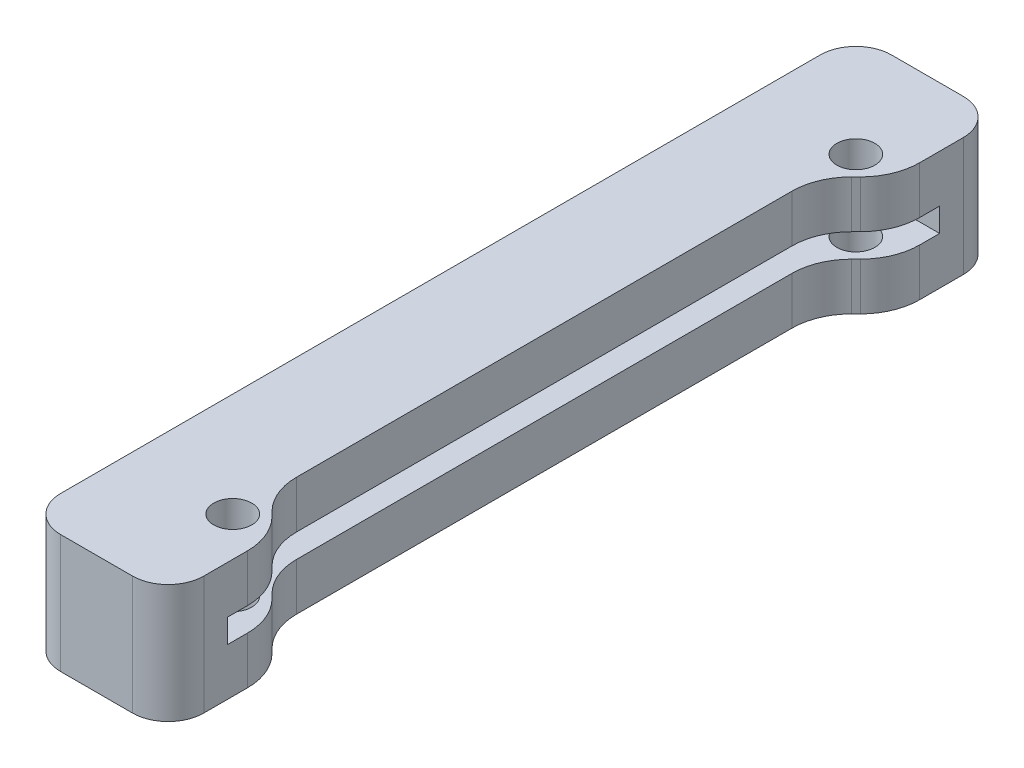
ISO-10303-21;
HEADER;
FILE_DESCRIPTION(('STEP AP214'),'2;1');
FILE_NAME('part.step','',(''),(''),'','','');
FILE_SCHEMA(('AUTOMOTIVE_DESIGN { 1 0 10303 214 1 1 1 1 }'));
ENDSEC;
DATA;
#1=APPLICATION_CONTEXT('core data for automotive mechanical design processes');
#2=APPLICATION_PROTOCOL_DEFINITION('international standard','automotive_design',2000,#1);
#3=PRODUCT_CONTEXT('',#1,'mechanical');
#4=PRODUCT('Part','Part','',(#3));
#5=PRODUCT_RELATED_PRODUCT_CATEGORY('part','',(#4));
#6=PRODUCT_DEFINITION_FORMATION('','',#4);
#7=PRODUCT_DEFINITION_CONTEXT('part definition',#1,'design');
#8=PRODUCT_DEFINITION('design','',#6,#7);
#9=PRODUCT_DEFINITION_SHAPE('','',#8);
#10=(LENGTH_UNIT() NAMED_UNIT(*) SI_UNIT(.MILLI.,.METRE.));
#11=(NAMED_UNIT(*) PLANE_ANGLE_UNIT() SI_UNIT($,.RADIAN.));
#12=(NAMED_UNIT(*) SI_UNIT($,.STERADIAN.) SOLID_ANGLE_UNIT());
#13=UNCERTAINTY_MEASURE_WITH_UNIT(LENGTH_MEASURE(1.E-05),#10,'distance_accuracy_value','');
#14=(GEOMETRIC_REPRESENTATION_CONTEXT(3) GLOBAL_UNCERTAINTY_ASSIGNED_CONTEXT((#13)) GLOBAL_UNIT_ASSIGNED_CONTEXT((#10,
#11,#12)) REPRESENTATION_CONTEXT('',''));
#15=CARTESIAN_POINT('',(0.,0.,0.));
#16=DIRECTION('',(0.,0.,1.));
#17=DIRECTION('',(1.,0.,0.));
#18=AXIS2_PLACEMENT_3D('',#15,#16,#17);
#19=CARTESIAN_POINT('',(-81.6925612369298,5.,26.25));
#20=DIRECTION('',(-1.,0.,0.));
#21=DIRECTION('',(0.,0.,1.));
#22=AXIS2_PLACEMENT_3D('',#19,#20,#21);
#23=PLANE('',#22);
#24=DIRECTION('',(0.,0.,-1.));
#25=VECTOR('',#24,1.);
#26=CARTESIAN_POINT('',(-81.6925612369298,5.,35.));
#27=LINE('',#26,#25);
#28=CARTESIAN_POINT('',(-81.6925612369298,5.,32.));
#29=VERTEX_POINT('',#28);
#30=CARTESIAN_POINT('',(-81.6925612369298,5.,28.3210678118655));
#31=VERTEX_POINT('',#30);
#32=EDGE_CURVE('E349',#29,#31,#27,.T.);
#33=ORIENTED_EDGE('',*,*,#32,.F.);
#34=DIRECTION('',(0.,-1.,0.));
#35=VECTOR('',#34,1.);
#36=CARTESIAN_POINT('',(-81.6925612369298,5.,32.));
#37=LINE('',#36,#35);
#38=CARTESIAN_POINT('',(-81.6925612369298,-5.,32.));
#39=VERTEX_POINT('',#38);
#40=EDGE_CURVE('E11',#29,#39,#37,.T.);
#41=ORIENTED_EDGE('',*,*,#40,.T.);
#42=DIRECTION('',(0.,0.,-1.));
#43=VECTOR('',#42,1.);
#44=CARTESIAN_POINT('',(-81.6925612369298,-5.,26.25));
#45=LINE('',#44,#43);
#46=CARTESIAN_POINT('',(-81.6925612369298,-5.,28.3210678118655));
#47=VERTEX_POINT('',#46);
#48=EDGE_CURVE('E375',#39,#47,#45,.T.);
#49=ORIENTED_EDGE('',*,*,#48,.T.);
#50=DIRECTION('',(0.,-1.,0.));
#51=VECTOR('',#50,1.);
#52=CARTESIAN_POINT('',(-81.6925612369298,5.,28.3210678118655));
#53=LINE('',#52,#51);
#54=CARTESIAN_POINT('',(-81.6925612369298,-1.,28.3210678118655));
#55=VERTEX_POINT('',#54);
#56=EDGE_CURVE('E422',#47,#55,#53,.F.);
#57=ORIENTED_EDGE('',*,*,#56,.T.);
#58=DIRECTION('',(0.,0.,-1.));
#59=VECTOR('',#58,1.);
#60=CARTESIAN_POINT('',(-81.6925612369298,-1.,26.25));
#61=LINE('',#60,#59);
#62=CARTESIAN_POINT('',(-81.6925612369298,-1.,30.));
#63=VERTEX_POINT('',#62);
#64=EDGE_CURVE('E314',#63,#55,#61,.T.);
#65=ORIENTED_EDGE('',*,*,#64,.F.);
#66=DIRECTION('',(0.,1.,0.));
#67=VECTOR('',#66,1.);
#68=CARTESIAN_POINT('',(-81.6925612369298,5.,30.));
#69=LINE('',#68,#67);
#70=CARTESIAN_POINT('',(-81.6925612369298,1.,30.));
#71=VERTEX_POINT('',#70);
#72=EDGE_CURVE('E246',#63,#71,#69,.T.);
#73=ORIENTED_EDGE('',*,*,#72,.T.);
#74=DIRECTION('',(0.,0.,-1.));
#75=VECTOR('',#74,1.);
#76=CARTESIAN_POINT('',(-81.6925612369298,1.,26.25));
#77=LINE('',#76,#75);
#78=CARTESIAN_POINT('',(-81.6925612369298,1.,28.3210678118655));
#79=VERTEX_POINT('',#78);
#80=EDGE_CURVE('E290',#71,#79,#77,.T.);
#81=ORIENTED_EDGE('',*,*,#80,.T.);
#82=DIRECTION('',(0.,-1.,0.));
#83=VECTOR('',#82,1.);
#84=CARTESIAN_POINT('',(-81.6925612369298,5.,28.3210678118655));
#85=LINE('',#84,#83);
#86=EDGE_CURVE('E418',#79,#31,#85,.F.);
#87=ORIENTED_EDGE('',*,*,#86,.T.);
#88=EDGE_LOOP('',(#33,#41,#49,#57,#65,#73,#81,#87));
#89=FACE_BOUND('',#88,.T.);
#90=ADVANCED_FACE('F39',(#89),#23,.F.);
#91=CARTESIAN_POINT('',(-81.6925612369298,5.,26.25));
#92=DIRECTION('',(-0.707106781186545,0.,0.70710678118655));
#93=DIRECTION('',(0.70710678118655,0.,0.707106781186545));
#94=AXIS2_PLACEMENT_3D('',#91,#92,#93);
#95=PLANE('',#94);
#96=DIRECTION('',(-0.70710678118655,0.,-0.707106781186545));
#97=VECTOR('',#96,1.);
#98=CARTESIAN_POINT('',(-81.6925612369298,-1.,26.25));
#99=LINE('',#98,#97);
#100=CARTESIAN_POINT('',(-83.1570273309971,-1.,24.7855339059327));
#101=VERTEX_POINT('',#100);
#102=CARTESIAN_POINT('',(-83.5355339059327,-1.,24.4070273309971));
#103=VERTEX_POINT('',#102);
#104=EDGE_CURVE('E310',#101,#103,#99,.T.);
#105=ORIENTED_EDGE('',*,*,#104,.F.);
#106=DIRECTION('',(0.,-1.,0.));
#107=VECTOR('',#106,1.);
#108=CARTESIAN_POINT('',(-83.1570273309971,5.,24.7855339059327));
#109=LINE('',#108,#107);
#110=CARTESIAN_POINT('',(-83.1570273309971,-5.,24.7855339059327));
#111=VERTEX_POINT('',#110);
#112=EDGE_CURVE('E407',#101,#111,#109,.T.);
#113=ORIENTED_EDGE('',*,*,#112,.T.);
#114=DIRECTION('',(-0.70710678118655,0.,-0.707106781186545));
#115=VECTOR('',#114,1.);
#116=CARTESIAN_POINT('',(-81.6925612369298,-5.,26.25));
#117=LINE('',#116,#115);
#118=CARTESIAN_POINT('',(-83.5355339059327,-5.,24.4070273309971));
#119=VERTEX_POINT('',#118);
#120=EDGE_CURVE('E378',#111,#119,#117,.T.);
#121=ORIENTED_EDGE('',*,*,#120,.T.);
#122=DIRECTION('',(0.,-1.,0.));
#123=VECTOR('',#122,1.);
#124=CARTESIAN_POINT('',(-83.5355339059327,-1.,24.4070273309971));
#125=LINE('',#124,#123);
#126=EDGE_CURVE('E404',#119,#103,#125,.F.);
#127=ORIENTED_EDGE('',*,*,#126,.T.);
#128=EDGE_LOOP('',(#105,#113,#121,#127));
#129=FACE_BOUND('',#128,.T.);
#130=ADVANCED_FACE('F591',(#129),#95,.F.);
#131=CARTESIAN_POINT('',(-85.,5.,-22.9425612369298));
#132=DIRECTION('',(-1.,0.,0.));
#133=DIRECTION('',(0.,0.,1.));
#134=AXIS2_PLACEMENT_3D('',#131,#132,#133);
#135=PLANE('',#134);
#136=DIRECTION('',(0.,0.,-1.));
#137=VECTOR('',#136,1.);
#138=CARTESIAN_POINT('',(-85.,-1.,-22.9425612369298));
#139=LINE('',#138,#137);
#140=CARTESIAN_POINT('',(-85.,-1.,20.8714934250644));
#141=VERTEX_POINT('',#140);
#142=CARTESIAN_POINT('',(-85.,-1.,-20.8714934250644));
#143=VERTEX_POINT('',#142);
#144=EDGE_CURVE('E306',#141,#143,#139,.T.);
#145=ORIENTED_EDGE('',*,*,#144,.F.);
#146=DIRECTION('',(0.,-1.,0.));
#147=VECTOR('',#146,1.);
#148=CARTESIAN_POINT('',(-85.,-5.,20.8714934250644));
#149=LINE('',#148,#147);
#150=CARTESIAN_POINT('',(-85.,-5.,20.8714934250644));
#151=VERTEX_POINT('',#150);
#152=EDGE_CURVE('E460',#141,#151,#149,.T.);
#153=ORIENTED_EDGE('',*,*,#152,.T.);
#154=DIRECTION('',(0.,0.,-1.));
#155=VECTOR('',#154,1.);
#156=CARTESIAN_POINT('',(-85.,-5.,-22.9425612369298));
#157=LINE('',#156,#155);
#158=CARTESIAN_POINT('',(-85.,-5.,-20.8714934250644));
#159=VERTEX_POINT('',#158);
#160=EDGE_CURVE('E382',#151,#159,#157,.T.);
#161=ORIENTED_EDGE('',*,*,#160,.T.);
#162=DIRECTION('',(0.,-1.,0.));
#163=VECTOR('',#162,1.);
#164=CARTESIAN_POINT('',(-85.,-1.,-20.8714934250644));
#165=LINE('',#164,#163);
#166=EDGE_CURVE('E457',#159,#143,#165,.F.);
#167=ORIENTED_EDGE('',*,*,#166,.T.);
#168=EDGE_LOOP('',(#145,#153,#161,#167));
#169=FACE_BOUND('',#168,.T.);
#170=ADVANCED_FACE('F600',(#169),#135,.F.);
#171=CARTESIAN_POINT('',(-81.6925612369298,5.,-26.25));
#172=DIRECTION('',(-0.707106781186549,0.,-0.707106781186546));
#173=DIRECTION('',(-0.707106781186546,0.,0.707106781186549));
#174=AXIS2_PLACEMENT_3D('',#171,#172,#173);
#175=PLANE('',#174);
#176=DIRECTION('',(0.707106781186546,0.,-0.707106781186549));
#177=VECTOR('',#176,1.);
#178=CARTESIAN_POINT('',(-81.6925612369298,-1.,-26.25));
#179=LINE('',#178,#177);
#180=CARTESIAN_POINT('',(-83.5355339059327,-1.,-24.4070273309971));
#181=VERTEX_POINT('',#180);
#182=CARTESIAN_POINT('',(-83.1570273309971,-1.,-24.7855339059328));
#183=VERTEX_POINT('',#182);
#184=EDGE_CURVE('E302',#181,#183,#179,.T.);
#185=ORIENTED_EDGE('',*,*,#184,.F.);
#186=DIRECTION('',(0.,-1.,0.));
#187=VECTOR('',#186,1.);
#188=CARTESIAN_POINT('',(-83.5355339059327,-5.,-24.4070273309971));
#189=LINE('',#188,#187);
#190=CARTESIAN_POINT('',(-83.5355339059327,-5.,-24.4070273309971));
#191=VERTEX_POINT('',#190);
#192=EDGE_CURVE('E467',#181,#191,#189,.T.);
#193=ORIENTED_EDGE('',*,*,#192,.T.);
#194=DIRECTION('',(0.707106781186546,0.,-0.707106781186549));
#195=VECTOR('',#194,1.);
#196=CARTESIAN_POINT('',(-81.6925612369298,-5.,-26.25));
#197=LINE('',#196,#195);
#198=CARTESIAN_POINT('',(-83.1570273309971,-5.,-24.7855339059328));
#199=VERTEX_POINT('',#198);
#200=EDGE_CURVE('E386',#191,#199,#197,.T.);
#201=ORIENTED_EDGE('',*,*,#200,.T.);
#202=DIRECTION('',(0.,-1.,0.));
#203=VECTOR('',#202,1.);
#204=CARTESIAN_POINT('',(-83.1570273309971,5.,-24.7855339059328));
#205=LINE('',#204,#203);
#206=EDGE_CURVE('E464',#199,#183,#205,.F.);
#207=ORIENTED_EDGE('',*,*,#206,.T.);
#208=EDGE_LOOP('',(#185,#193,#201,#207));
#209=FACE_BOUND('',#208,.T.);
#210=ADVANCED_FACE('F609',(#209),#175,.F.);
#211=CARTESIAN_POINT('',(-81.6925612369298,5.,-30.));
#212=DIRECTION('',(-1.,0.,0.));
#213=DIRECTION('',(0.,0.,1.));
#214=AXIS2_PLACEMENT_3D('',#211,#212,#213);
#215=PLANE('',#214);
#216=DIRECTION('',(0.,0.,-1.));
#217=VECTOR('',#216,1.);
#218=CARTESIAN_POINT('',(-81.6925612369298,-5.,-30.));
#219=LINE('',#218,#217);
#220=CARTESIAN_POINT('',(-81.6925612369298,-5.,-28.3210678118654));
#221=VERTEX_POINT('',#220);
#222=CARTESIAN_POINT('',(-81.6925612369298,-5.,-32.));
#223=VERTEX_POINT('',#222);
#224=EDGE_CURVE('E339',#221,#223,#219,.T.);
#225=ORIENTED_EDGE('',*,*,#224,.T.);
#226=DIRECTION('',(0.,-1.,0.));
#227=VECTOR('',#226,1.);
#228=CARTESIAN_POINT('',(-81.6925612369298,5.,-32.));
#229=LINE('',#228,#227);
#230=CARTESIAN_POINT('',(-81.6925612369298,5.,-32.));
#231=VERTEX_POINT('',#230);
#232=EDGE_CURVE('E529',#223,#231,#229,.F.);
#233=ORIENTED_EDGE('',*,*,#232,.T.);
#234=DIRECTION('',(0.,0.,-1.));
#235=VECTOR('',#234,1.);
#236=CARTESIAN_POINT('',(-81.6925612369298,5.,-30.));
#237=LINE('',#236,#235);
#238=CARTESIAN_POINT('',(-81.6925612369298,5.,-28.3210678118654));
#239=VERTEX_POINT('',#238);
#240=EDGE_CURVE('E334',#239,#231,#237,.T.);
#241=ORIENTED_EDGE('',*,*,#240,.F.);
#242=DIRECTION('',(0.,-1.,0.));
#243=VECTOR('',#242,1.);
#244=CARTESIAN_POINT('',(-81.6925612369298,5.,-28.3210678118654));
#245=LINE('',#244,#243);
#246=CARTESIAN_POINT('',(-81.6925612369298,1.,-28.3210678118654));
#247=VERTEX_POINT('',#246);
#248=EDGE_CURVE('E478',#239,#247,#245,.T.);
#249=ORIENTED_EDGE('',*,*,#248,.T.);
#250=DIRECTION('',(0.,0.,-1.));
#251=VECTOR('',#250,1.);
#252=CARTESIAN_POINT('',(-81.6925612369298,1.,-30.));
#253=LINE('',#252,#251);
#254=CARTESIAN_POINT('',(-81.6925612369298,1.,-30.));
#255=VERTEX_POINT('',#254);
#256=EDGE_CURVE('E275',#247,#255,#253,.T.);
#257=ORIENTED_EDGE('',*,*,#256,.T.);
#258=DIRECTION('',(0.,-1.,0.));
#259=VECTOR('',#258,1.);
#260=CARTESIAN_POINT('',(-81.6925612369298,5.,-30.));
#261=LINE('',#260,#259);
#262=CARTESIAN_POINT('',(-81.6925612369298,-1.,-30.));
#263=VERTEX_POINT('',#262);
#264=EDGE_CURVE('E364',#255,#263,#261,.T.);
#265=ORIENTED_EDGE('',*,*,#264,.T.);
#266=DIRECTION('',(0.,0.,-1.));
#267=VECTOR('',#266,1.);
#268=CARTESIAN_POINT('',(-81.6925612369298,-1.,-30.));
#269=LINE('',#268,#267);
#270=CARTESIAN_POINT('',(-81.6925612369298,-1.,-28.3210678118654));
#271=VERTEX_POINT('',#270);
#272=EDGE_CURVE('E299',#271,#263,#269,.T.);
#273=ORIENTED_EDGE('',*,*,#272,.F.);
#274=DIRECTION('',(0.,-1.,0.));
#275=VECTOR('',#274,1.);
#276=CARTESIAN_POINT('',(-81.6925612369298,5.,-28.3210678118654));
#277=LINE('',#276,#275);
#278=EDGE_CURVE('E482',#271,#221,#277,.T.);
#279=ORIENTED_EDGE('',*,*,#278,.T.);
#280=EDGE_LOOP('',(#225,#233,#241,#249,#257,#265,#273,#279));
#281=FACE_BOUND('',#280,.T.);
#282=ADVANCED_FACE('F618',(#281),#215,.F.);
#283=CARTESIAN_POINT('',(-85.,5.,-26.25));
#284=DIRECTION('',(0.,-1.,0.));
#285=DIRECTION('',(0.,0.,-1.));
#286=AXIS2_PLACEMENT_3D('',#283,#284,#285);
#287=CYLINDRICAL_SURFACE('',#286,1.6);
#288=CARTESIAN_POINT('',(-85.,-5.,-26.25));
#289=DIRECTION('',(0.,1.,0.));
#290=DIRECTION('',(0.,0.,1.));
#291=AXIS2_PLACEMENT_3D('',#288,#289,#290);
#292=CIRCLE('',#291,1.6);
#293=CARTESIAN_POINT('',(-85.,-5.,-24.65));
#294=VERTEX_POINT('',#293);
#295=EDGE_CURVE('E322',#294,#294,#292,.T.);
#296=ORIENTED_EDGE('',*,*,#295,.F.);
#297=EDGE_LOOP('',(#296));
#298=FACE_BOUND('',#297,.T.);
#299=CARTESIAN_POINT('',(-85.,-1.,-26.25));
#300=DIRECTION('',(0.,1.,0.));
#301=DIRECTION('',(0.,0.,1.));
#302=AXIS2_PLACEMENT_3D('',#299,#300,#301);
#303=CIRCLE('',#302,1.6);
#304=CARTESIAN_POINT('',(-85.,-1.,-24.65));
#305=VERTEX_POINT('',#304);
#306=EDGE_CURVE('E295',#305,#305,#303,.T.);
#307=ORIENTED_EDGE('',*,*,#306,.T.);
#308=EDGE_LOOP('',(#307));
#309=FACE_BOUND('',#308,.T.);
#310=ADVANCED_FACE('F695',(#298,#309),#287,.F.);
#311=CARTESIAN_POINT('',(-85.,5.,26.25));
#312=DIRECTION('',(0.,-1.,0.));
#313=DIRECTION('',(0.,0.,-1.));
#314=AXIS2_PLACEMENT_3D('',#311,#312,#313);
#315=CYLINDRICAL_SURFACE('',#314,1.6);
#316=CARTESIAN_POINT('',(-85.,-5.,26.25));
#317=DIRECTION('',(0.,1.,0.));
#318=DIRECTION('',(0.,0.,1.));
#319=AXIS2_PLACEMENT_3D('',#316,#317,#318);
#320=CIRCLE('',#319,1.6);
#321=CARTESIAN_POINT('',(-85.,-5.,27.85));
#322=VERTEX_POINT('',#321);
#323=EDGE_CURVE('E317',#322,#322,#320,.T.);
#324=ORIENTED_EDGE('',*,*,#323,.F.);
#325=EDGE_LOOP('',(#324));
#326=FACE_BOUND('',#325,.T.);
#327=CARTESIAN_POINT('',(-85.,-1.,26.25));
#328=DIRECTION('',(0.,1.,0.));
#329=DIRECTION('',(0.,0.,1.));
#330=AXIS2_PLACEMENT_3D('',#327,#328,#329);
#331=CIRCLE('',#330,1.6);
#332=CARTESIAN_POINT('',(-85.,-1.,27.85));
#333=VERTEX_POINT('',#332);
#334=EDGE_CURVE('E294',#333,#333,#331,.T.);
#335=ORIENTED_EDGE('',*,*,#334,.T.);
#336=EDGE_LOOP('',(#335));
#337=FACE_BOUND('',#336,.T.);
#338=ADVANCED_FACE('F691',(#326,#337),#315,.F.);
#339=CARTESIAN_POINT('',(0.,5.,0.));
#340=DIRECTION('',(0.,1.,0.));
#341=DIRECTION('',(0.,0.,1.));
#342=AXIS2_PLACEMENT_3D('',#339,#340,#341);
#343=PLANE('',#342);
#344=CARTESIAN_POINT('',(-85.,5.,-26.25));
#345=DIRECTION('',(0.,1.,0.));
#346=DIRECTION('',(0.,0.,1.));
#347=AXIS2_PLACEMENT_3D('',#344,#345,#346);
#348=CIRCLE('',#347,1.6);
#349=CARTESIAN_POINT('',(-85.,5.,-24.65));
#350=VERTEX_POINT('',#349);
#351=EDGE_CURVE('E326',#350,#350,#348,.T.);
#352=ORIENTED_EDGE('',*,*,#351,.F.);
#353=EDGE_LOOP('',(#352));
#354=FACE_BOUND('',#353,.T.);
#355=ORIENTED_EDGE('',*,*,#240,.T.);
#356=CARTESIAN_POINT('',(-84.6925612369298,5.,-32.));
#357=DIRECTION('',(0.,1.,0.));
#358=DIRECTION('',(0.,0.,1.));
#359=AXIS2_PLACEMENT_3D('',#356,#357,#358);
#360=CIRCLE('',#359,3.);
#361=CARTESIAN_POINT('',(-84.6925612369298,5.,-35.));
#362=VERTEX_POINT('',#361);
#363=EDGE_CURVE('E540',#231,#362,#360,.T.);
#364=ORIENTED_EDGE('',*,*,#363,.T.);
#365=DIRECTION('',(-1.,0.,0.));
#366=VECTOR('',#365,1.);
#367=CARTESIAN_POINT('',(-81.6925612369298,5.,-35.));
#368=LINE('',#367,#366);
#369=CARTESIAN_POINT('',(-90.75,5.,-35.));
#370=VERTEX_POINT('',#369);
#371=EDGE_CURVE('E338',#362,#370,#368,.T.);
#372=ORIENTED_EDGE('',*,*,#371,.T.);
#373=CARTESIAN_POINT('',(-90.75,5.,-32.));
#374=DIRECTION('',(0.,1.,0.));
#375=DIRECTION('',(0.,0.,1.));
#376=AXIS2_PLACEMENT_3D('',#373,#374,#375);
#377=CIRCLE('',#376,3.);
#378=CARTESIAN_POINT('',(-93.75,5.,-32.));
#379=VERTEX_POINT('',#378);
#380=EDGE_CURVE('E537',#370,#379,#377,.T.);
#381=ORIENTED_EDGE('',*,*,#380,.T.);
#382=DIRECTION('',(0.,0.,1.));
#383=VECTOR('',#382,1.);
#384=CARTESIAN_POINT('',(-93.75,5.,-35.));
#385=LINE('',#384,#383);
#386=CARTESIAN_POINT('',(-93.75,5.,32.));
#387=VERTEX_POINT('',#386);
#388=EDGE_CURVE('E343',#379,#387,#385,.T.);
#389=ORIENTED_EDGE('',*,*,#388,.T.);
#390=CARTESIAN_POINT('',(-90.75,5.,32.));
#391=DIRECTION('',(0.,1.,0.));
#392=DIRECTION('',(0.,0.,1.));
#393=AXIS2_PLACEMENT_3D('',#390,#391,#392);
#394=CIRCLE('',#393,3.);
#395=CARTESIAN_POINT('',(-90.75,5.,35.));
#396=VERTEX_POINT('',#395);
#397=EDGE_CURVE('E62',#387,#396,#394,.T.);
#398=ORIENTED_EDGE('',*,*,#397,.T.);
#399=DIRECTION('',(1.,0.,0.));
#400=VECTOR('',#399,1.);
#401=CARTESIAN_POINT('',(-93.75,5.,35.));
#402=LINE('',#401,#400);
#403=CARTESIAN_POINT('',(-84.6925612369298,5.,35.));
#404=VERTEX_POINT('',#403);
#405=EDGE_CURVE('E346',#396,#404,#402,.T.);
#406=ORIENTED_EDGE('',*,*,#405,.T.);
#407=CARTESIAN_POINT('',(-84.6925612369298,5.,32.));
#408=DIRECTION('',(0.,1.,0.));
#409=DIRECTION('',(0.,0.,1.));
#410=AXIS2_PLACEMENT_3D('',#407,#408,#409);
#411=CIRCLE('',#410,3.);
#412=EDGE_CURVE('E532',#404,#29,#411,.T.);
#413=ORIENTED_EDGE('',*,*,#412,.T.);
#414=ORIENTED_EDGE('',*,*,#32,.T.);
#415=CARTESIAN_POINT('',(-86.6925612369298,5.,28.3210678118655));
#416=DIRECTION('',(0.,1.,0.));
#417=DIRECTION('',(0.,0.,1.));
#418=AXIS2_PLACEMENT_3D('',#415,#416,#417);
#419=CIRCLE('',#418,5.);
#420=CARTESIAN_POINT('',(-83.1570273309971,5.,24.7855339059327));
#421=VERTEX_POINT('',#420);
#422=EDGE_CURVE('E447',#31,#421,#419,.T.);
#423=ORIENTED_EDGE('',*,*,#422,.T.);
#424=DIRECTION('',(-0.70710678118655,0.,-0.707106781186545));
#425=VECTOR('',#424,1.);
#426=CARTESIAN_POINT('',(-81.6925612369298,5.,26.25));
#427=LINE('',#426,#425);
#428=CARTESIAN_POINT('',(-83.5355339059327,5.,24.4070273309971));
#429=VERTEX_POINT('',#428);
#430=EDGE_CURVE('E352',#421,#429,#427,.T.);
#431=ORIENTED_EDGE('',*,*,#430,.T.);
#432=CARTESIAN_POINT('',(-80.,5.,20.8714934250644));
#433=DIRECTION('',(0.,1.,0.));
#434=DIRECTION('',(0.,0.,1.));
#435=AXIS2_PLACEMENT_3D('',#432,#433,#434);
#436=CIRCLE('',#435,5.);
#437=CARTESIAN_POINT('',(-85.,5.,20.8714934250644));
#438=VERTEX_POINT('',#437);
#439=EDGE_CURVE('E489',#429,#438,#436,.F.);
#440=ORIENTED_EDGE('',*,*,#439,.T.);
#441=DIRECTION('',(0.,0.,-1.));
#442=VECTOR('',#441,1.);
#443=CARTESIAN_POINT('',(-85.,5.,-22.9425612369298));
#444=LINE('',#443,#442);
#445=CARTESIAN_POINT('',(-85.,5.,-20.8714934250644));
#446=VERTEX_POINT('',#445);
#447=EDGE_CURVE('E356',#438,#446,#444,.T.);
#448=ORIENTED_EDGE('',*,*,#447,.T.);
#449=CARTESIAN_POINT('',(-80.,5.,-20.8714934250644));
#450=DIRECTION('',(0.,1.,0.));
#451=DIRECTION('',(0.,0.,1.));
#452=AXIS2_PLACEMENT_3D('',#449,#450,#451);
#453=CIRCLE('',#452,5.);
#454=CARTESIAN_POINT('',(-83.5355339059327,5.,-24.4070273309971));
#455=VERTEX_POINT('',#454);
#456=EDGE_CURVE('E507',#446,#455,#453,.F.);
#457=ORIENTED_EDGE('',*,*,#456,.T.);
#458=DIRECTION('',(0.707106781186546,0.,-0.707106781186549));
#459=VECTOR('',#458,1.);
#460=CARTESIAN_POINT('',(-81.6925612369298,5.,-26.25));
#461=LINE('',#460,#459);
#462=CARTESIAN_POINT('',(-83.1570273309971,5.,-24.7855339059328));
#463=VERTEX_POINT('',#462);
#464=EDGE_CURVE('E360',#455,#463,#461,.T.);
#465=ORIENTED_EDGE('',*,*,#464,.T.);
#466=CARTESIAN_POINT('',(-86.6925612369298,5.,-28.3210678118655));
#467=DIRECTION('',(0.,1.,0.));
#468=DIRECTION('',(0.,0.,1.));
#469=AXIS2_PLACEMENT_3D('',#466,#467,#468);
#470=CIRCLE('',#469,5.);
#471=EDGE_CURVE('E444',#463,#239,#470,.T.);
#472=ORIENTED_EDGE('',*,*,#471,.T.);
#473=EDGE_LOOP('',(#355,#364,#372,#381,#389,#398,#406,#413,#414,#423,#431,#440,#448,#457,#465,#472));
#474=FACE_BOUND('',#473,.T.);
#475=CARTESIAN_POINT('',(-85.,5.,26.25));
#476=DIRECTION('',(0.,1.,0.));
#477=DIRECTION('',(0.,0.,1.));
#478=AXIS2_PLACEMENT_3D('',#475,#476,#477);
#479=CIRCLE('',#478,1.6);
#480=CARTESIAN_POINT('',(-85.,5.,27.85));
#481=VERTEX_POINT('',#480);
#482=EDGE_CURVE('E318',#481,#481,#479,.T.);
#483=ORIENTED_EDGE('',*,*,#482,.F.);
#484=EDGE_LOOP('',(#483));
#485=FACE_BOUND('',#484,.T.);
#486=ADVANCED_FACE('F570',(#354,#474,#485),#343,.T.);
#487=CARTESIAN_POINT('',(0.,-5.,0.));
#488=DIRECTION('',(0.,1.,0.));
#489=DIRECTION('',(0.,0.,1.));
#490=AXIS2_PLACEMENT_3D('',#487,#488,#489);
#491=PLANE('',#490);
#492=DIRECTION('',(-1.,0.,0.));
#493=VECTOR('',#492,1.);
#494=CARTESIAN_POINT('',(-81.6925612369298,-5.,-35.));
#495=LINE('',#494,#493);
#496=CARTESIAN_POINT('',(-84.6925612369298,-5.,-35.));
#497=VERTEX_POINT('',#496);
#498=CARTESIAN_POINT('',(-90.75,-5.,-35.));
#499=VERTEX_POINT('',#498);
#500=EDGE_CURVE('E330',#497,#499,#495,.T.);
#501=ORIENTED_EDGE('',*,*,#500,.F.);
#502=CARTESIAN_POINT('',(-84.6925612369298,-5.,-32.));
#503=DIRECTION('',(0.,1.,0.));
#504=DIRECTION('',(0.,0.,1.));
#505=AXIS2_PLACEMENT_3D('',#502,#503,#504);
#506=CIRCLE('',#505,3.);
#507=EDGE_CURVE('E526',#497,#223,#506,.F.);
#508=ORIENTED_EDGE('',*,*,#507,.T.);
#509=ORIENTED_EDGE('',*,*,#224,.F.);
#510=CARTESIAN_POINT('',(-86.6925612369298,-5.,-28.3210678118655));
#511=DIRECTION('',(0.,1.,0.));
#512=DIRECTION('',(0.,0.,1.));
#513=AXIS2_PLACEMENT_3D('',#510,#511,#512);
#514=CIRCLE('',#513,5.);
#515=EDGE_CURVE('E411',#221,#199,#514,.F.);
#516=ORIENTED_EDGE('',*,*,#515,.T.);
#517=ORIENTED_EDGE('',*,*,#200,.F.);
#518=CARTESIAN_POINT('',(-80.,-5.,-20.8714934250644));
#519=DIRECTION('',(0.,1.,0.));
#520=DIRECTION('',(0.,0.,1.));
#521=AXIS2_PLACEMENT_3D('',#518,#519,#520);
#522=CIRCLE('',#521,5.);
#523=EDGE_CURVE('E498',#191,#159,#522,.T.);
#524=ORIENTED_EDGE('',*,*,#523,.T.);
#525=ORIENTED_EDGE('',*,*,#160,.F.);
#526=CARTESIAN_POINT('',(-80.,-5.,20.8714934250644));
#527=DIRECTION('',(0.,1.,0.));
#528=DIRECTION('',(0.,0.,1.));
#529=AXIS2_PLACEMENT_3D('',#526,#527,#528);
#530=CIRCLE('',#529,5.);
#531=EDGE_CURVE('E492',#151,#119,#530,.T.);
#532=ORIENTED_EDGE('',*,*,#531,.T.);
#533=ORIENTED_EDGE('',*,*,#120,.F.);
#534=CARTESIAN_POINT('',(-86.6925612369298,-5.,28.3210678118655));
#535=DIRECTION('',(0.,1.,0.));
#536=DIRECTION('',(0.,0.,1.));
#537=AXIS2_PLACEMENT_3D('',#534,#535,#536);
#538=CIRCLE('',#537,5.);
#539=EDGE_CURVE('E414',#111,#47,#538,.F.);
#540=ORIENTED_EDGE('',*,*,#539,.T.);
#541=ORIENTED_EDGE('',*,*,#48,.F.);
#542=CARTESIAN_POINT('',(-84.6925612369298,-5.,32.));
#543=DIRECTION('',(0.,1.,0.));
#544=DIRECTION('',(0.,0.,1.));
#545=AXIS2_PLACEMENT_3D('',#542,#543,#544);
#546=CIRCLE('',#545,3.);
#547=CARTESIAN_POINT('',(-84.6925612369298,-5.,35.));
#548=VERTEX_POINT('',#547);
#549=EDGE_CURVE('E517',#39,#548,#546,.F.);
#550=ORIENTED_EDGE('',*,*,#549,.T.);
#551=DIRECTION('',(1.,0.,0.));
#552=VECTOR('',#551,1.);
#553=CARTESIAN_POINT('',(-93.75,-5.,35.));
#554=LINE('',#553,#552);
#555=CARTESIAN_POINT('',(-90.75,-5.,35.));
#556=VERTEX_POINT('',#555);
#557=EDGE_CURVE('E372',#556,#548,#554,.T.);
#558=ORIENTED_EDGE('',*,*,#557,.F.);
#559=CARTESIAN_POINT('',(-90.75,-5.,32.));
#560=DIRECTION('',(0.,1.,0.));
#561=DIRECTION('',(0.,0.,1.));
#562=AXIS2_PLACEMENT_3D('',#559,#560,#561);
#563=CIRCLE('',#562,3.);
#564=CARTESIAN_POINT('',(-93.75,-5.,32.));
#565=VERTEX_POINT('',#564);
#566=EDGE_CURVE('E520',#556,#565,#563,.F.);
#567=ORIENTED_EDGE('',*,*,#566,.T.);
#568=DIRECTION('',(0.,0.,1.));
#569=VECTOR('',#568,1.);
#570=CARTESIAN_POINT('',(-93.75,-5.,-35.));
#571=LINE('',#570,#569);
#572=CARTESIAN_POINT('',(-93.75,-5.,-32.));
#573=VERTEX_POINT('',#572);
#574=EDGE_CURVE('E368',#573,#565,#571,.T.);
#575=ORIENTED_EDGE('',*,*,#574,.F.);
#576=CARTESIAN_POINT('',(-90.75,-5.,-32.));
#577=DIRECTION('',(0.,1.,0.));
#578=DIRECTION('',(0.,0.,1.));
#579=AXIS2_PLACEMENT_3D('',#576,#577,#578);
#580=CIRCLE('',#579,3.);
#581=EDGE_CURVE('E523',#573,#499,#580,.F.);
#582=ORIENTED_EDGE('',*,*,#581,.T.);
#583=EDGE_LOOP('',(#501,#508,#509,#516,#517,#524,#525,#532,#533,#540,#541,#550,#558,#567,#575,#582));
#584=FACE_BOUND('',#583,.T.);
#585=ORIENTED_EDGE('',*,*,#295,.T.);
#586=EDGE_LOOP('',(#585));
#587=FACE_BOUND('',#586,.T.);
#588=ORIENTED_EDGE('',*,*,#323,.T.);
#589=EDGE_LOOP('',(#588));
#590=FACE_BOUND('',#589,.T.);
#591=ADVANCED_FACE('F559',(#584,#587,#590),#491,.F.);
#592=CARTESIAN_POINT('',(-81.6925612369298,5.,-35.));
#593=DIRECTION('',(0.,0.,1.));
#594=DIRECTION('',(1.,0.,0.));
#595=AXIS2_PLACEMENT_3D('',#592,#593,#594);
#596=PLANE('',#595);
#597=ORIENTED_EDGE('',*,*,#371,.F.);
#598=DIRECTION('',(0.,-1.,0.));
#599=VECTOR('',#598,1.);
#600=CARTESIAN_POINT('',(-84.6925612369298,5.,-35.));
#601=LINE('',#600,#599);
#602=EDGE_CURVE('E513',#362,#497,#601,.T.);
#603=ORIENTED_EDGE('',*,*,#602,.T.);
#604=ORIENTED_EDGE('',*,*,#500,.T.);
#605=DIRECTION('',(0.,-1.,0.));
#606=VECTOR('',#605,1.);
#607=CARTESIAN_POINT('',(-90.75,5.,-35.));
#608=LINE('',#607,#606);
#609=EDGE_CURVE('E510',#499,#370,#608,.F.);
#610=ORIENTED_EDGE('',*,*,#609,.T.);
#611=EDGE_LOOP('',(#597,#603,#604,#610));
#612=FACE_BOUND('',#611,.T.);
#613=ADVANCED_FACE('F668',(#612),#596,.F.);
#614=CARTESIAN_POINT('',(-93.75,5.,-35.));
#615=DIRECTION('',(1.,0.,0.));
#616=DIRECTION('',(0.,0.,-1.));
#617=AXIS2_PLACEMENT_3D('',#614,#615,#616);
#618=PLANE('',#617);
#619=ORIENTED_EDGE('',*,*,#388,.F.);
#620=DIRECTION('',(0.,-1.,0.));
#621=VECTOR('',#620,1.);
#622=CARTESIAN_POINT('',(-93.75,5.,-32.));
#623=LINE('',#622,#621);
#624=EDGE_CURVE('E546',#379,#573,#623,.T.);
#625=ORIENTED_EDGE('',*,*,#624,.T.);
#626=ORIENTED_EDGE('',*,*,#574,.T.);
#627=DIRECTION('',(0.,-1.,0.));
#628=VECTOR('',#627,1.);
#629=CARTESIAN_POINT('',(-93.75,5.,32.));
#630=LINE('',#629,#628);
#631=EDGE_CURVE('E543',#565,#387,#630,.F.);
#632=ORIENTED_EDGE('',*,*,#631,.T.);
#633=EDGE_LOOP('',(#619,#625,#626,#632));
#634=FACE_BOUND('',#633,.T.);
#635=ADVANCED_FACE('F665',(#634),#618,.F.);
#636=CARTESIAN_POINT('',(-93.75,5.,35.));
#637=DIRECTION('',(0.,0.,-1.));
#638=DIRECTION('',(-1.,0.,0.));
#639=AXIS2_PLACEMENT_3D('',#636,#637,#638);
#640=PLANE('',#639);
#641=ORIENTED_EDGE('',*,*,#405,.F.);
#642=DIRECTION('',(0.,-1.,0.));
#643=VECTOR('',#642,1.);
#644=CARTESIAN_POINT('',(-90.75,5.,35.));
#645=LINE('',#644,#643);
#646=EDGE_CURVE('E48',#396,#556,#645,.T.);
#647=ORIENTED_EDGE('',*,*,#646,.T.);
#648=ORIENTED_EDGE('',*,*,#557,.T.);
#649=DIRECTION('',(0.,-1.,0.));
#650=VECTOR('',#649,1.);
#651=CARTESIAN_POINT('',(-84.6925612369298,5.,35.));
#652=LINE('',#651,#650);
#653=EDGE_CURVE('E55',#548,#404,#652,.F.);
#654=ORIENTED_EDGE('',*,*,#653,.T.);
#655=EDGE_LOOP('',(#641,#647,#648,#654));
#656=FACE_BOUND('',#655,.T.);
#657=ADVANCED_FACE('F555',(#656),#640,.F.);
#658=ORIENTED_EDGE('',*,*,#430,.F.);
#659=DIRECTION('',(0.,-1.,0.));
#660=VECTOR('',#659,1.);
#661=CARTESIAN_POINT('',(-83.1570273309971,5.,24.7855339059327));
#662=LINE('',#661,#660);
#663=CARTESIAN_POINT('',(-83.1570273309971,1.,24.7855339059327));
#664=VERTEX_POINT('',#663);
#665=EDGE_CURVE('E434',#421,#664,#662,.T.);
#666=ORIENTED_EDGE('',*,*,#665,.T.);
#667=DIRECTION('',(-0.70710678118655,0.,-0.707106781186545));
#668=VECTOR('',#667,1.);
#669=CARTESIAN_POINT('',(-81.6925612369298,1.,26.25));
#670=LINE('',#669,#668);
#671=CARTESIAN_POINT('',(-83.5355339059327,1.,24.4070273309971));
#672=VERTEX_POINT('',#671);
#673=EDGE_CURVE('E286',#664,#672,#670,.T.);
#674=ORIENTED_EDGE('',*,*,#673,.T.);
#675=DIRECTION('',(0.,-1.,0.));
#676=VECTOR('',#675,1.);
#677=CARTESIAN_POINT('',(-83.5355339059327,5.,24.4070273309971));
#678=LINE('',#677,#676);
#679=EDGE_CURVE('E431',#672,#429,#678,.F.);
#680=ORIENTED_EDGE('',*,*,#679,.T.);
#681=EDGE_LOOP('',(#658,#666,#674,#680));
#682=FACE_BOUND('',#681,.T.);
#683=ADVANCED_FACE('F577',(#682),#95,.F.);
#684=ORIENTED_EDGE('',*,*,#447,.F.);
#685=DIRECTION('',(0.,-1.,0.));
#686=VECTOR('',#685,1.);
#687=CARTESIAN_POINT('',(-85.,1.,20.8714934250644));
#688=LINE('',#687,#686);
#689=CARTESIAN_POINT('',(-85.,1.,20.8714934250644));
#690=VERTEX_POINT('',#689);
#691=EDGE_CURVE('E453',#438,#690,#688,.T.);
#692=ORIENTED_EDGE('',*,*,#691,.T.);
#693=DIRECTION('',(0.,0.,-1.));
#694=VECTOR('',#693,1.);
#695=CARTESIAN_POINT('',(-85.,1.,-22.9425612369298));
#696=LINE('',#695,#694);
#697=CARTESIAN_POINT('',(-85.,1.,-20.8714934250644));
#698=VERTEX_POINT('',#697);
#699=EDGE_CURVE('E282',#690,#698,#696,.T.);
#700=ORIENTED_EDGE('',*,*,#699,.T.);
#701=DIRECTION('',(0.,-1.,0.));
#702=VECTOR('',#701,1.);
#703=CARTESIAN_POINT('',(-85.,5.,-20.8714934250644));
#704=LINE('',#703,#702);
#705=EDGE_CURVE('E450',#698,#446,#704,.F.);
#706=ORIENTED_EDGE('',*,*,#705,.T.);
#707=EDGE_LOOP('',(#684,#692,#700,#706));
#708=FACE_BOUND('',#707,.T.);
#709=ADVANCED_FACE('F643',(#708),#135,.F.);
#710=ORIENTED_EDGE('',*,*,#464,.F.);
#711=DIRECTION('',(0.,-1.,0.));
#712=VECTOR('',#711,1.);
#713=CARTESIAN_POINT('',(-83.5355339059327,1.,-24.4070273309971));
#714=LINE('',#713,#712);
#715=CARTESIAN_POINT('',(-83.5355339059327,1.,-24.4070273309971));
#716=VERTEX_POINT('',#715);
#717=EDGE_CURVE('E474',#455,#716,#714,.T.);
#718=ORIENTED_EDGE('',*,*,#717,.T.);
#719=DIRECTION('',(0.707106781186546,0.,-0.707106781186549));
#720=VECTOR('',#719,1.);
#721=CARTESIAN_POINT('',(-81.6925612369298,1.,-26.25));
#722=LINE('',#721,#720);
#723=CARTESIAN_POINT('',(-83.1570273309971,1.,-24.7855339059328));
#724=VERTEX_POINT('',#723);
#725=EDGE_CURVE('E278',#716,#724,#722,.T.);
#726=ORIENTED_EDGE('',*,*,#725,.T.);
#727=DIRECTION('',(0.,-1.,0.));
#728=VECTOR('',#727,1.);
#729=CARTESIAN_POINT('',(-83.1570273309971,5.,-24.7855339059328));
#730=LINE('',#729,#728);
#731=EDGE_CURVE('E471',#724,#463,#730,.F.);
#732=ORIENTED_EDGE('',*,*,#731,.T.);
#733=EDGE_LOOP('',(#710,#718,#726,#732));
#734=FACE_BOUND('',#733,.T.);
#735=ADVANCED_FACE('F634',(#734),#175,.F.);
#736=CARTESIAN_POINT('',(-85.,1.,-26.25));
#737=DIRECTION('',(0.,1.,0.));
#738=DIRECTION('',(0.,0.,1.));
#739=AXIS2_PLACEMENT_3D('',#736,#737,#738);
#740=CIRCLE('',#739,1.6);
#741=CARTESIAN_POINT('',(-85.,1.,-24.65));
#742=VERTEX_POINT('',#741);
#743=EDGE_CURVE('E271',#742,#742,#740,.T.);
#744=ORIENTED_EDGE('',*,*,#743,.F.);
#745=EDGE_LOOP('',(#744));
#746=FACE_BOUND('',#745,.T.);
#747=ORIENTED_EDGE('',*,*,#351,.T.);
#748=EDGE_LOOP('',(#747));
#749=FACE_BOUND('',#748,.T.);
#750=ADVANCED_FACE('F689',(#746,#749),#287,.F.);
#751=CARTESIAN_POINT('',(-85.,1.,26.25));
#752=DIRECTION('',(0.,1.,0.));
#753=DIRECTION('',(0.,0.,1.));
#754=AXIS2_PLACEMENT_3D('',#751,#752,#753);
#755=CIRCLE('',#754,1.6);
#756=CARTESIAN_POINT('',(-85.,1.,27.85));
#757=VERTEX_POINT('',#756);
#758=EDGE_CURVE('E269',#757,#757,#755,.T.);
#759=ORIENTED_EDGE('',*,*,#758,.F.);
#760=EDGE_LOOP('',(#759));
#761=FACE_BOUND('',#760,.T.);
#762=ORIENTED_EDGE('',*,*,#482,.T.);
#763=EDGE_LOOP('',(#762));
#764=FACE_BOUND('',#763,.T.);
#765=ADVANCED_FACE('F686',(#761,#764),#315,.F.);
#766=CARTESIAN_POINT('',(-88.75,-1.,30.));
#767=DIRECTION('',(0.,0.,1.));
#768=DIRECTION('',(1.,0.,0.));
#769=AXIS2_PLACEMENT_3D('',#766,#767,#768);
#770=PLANE('',#769);
#771=DIRECTION('',(1.,0.,0.));
#772=VECTOR('',#771,1.);
#773=CARTESIAN_POINT('',(-88.75,-1.,30.));
#774=LINE('',#773,#772);
#775=CARTESIAN_POINT('',(-88.75,-1.,30.));
#776=VERTEX_POINT('',#775);
#777=EDGE_CURVE('E243',#776,#63,#774,.T.);
#778=ORIENTED_EDGE('',*,*,#777,.F.);
#779=DIRECTION('',(0.,1.,0.));
#780=VECTOR('',#779,1.);
#781=CARTESIAN_POINT('',(-88.75,-1.,30.));
#782=LINE('',#781,#780);
#783=CARTESIAN_POINT('',(-88.75,1.,30.));
#784=VERTEX_POINT('',#783);
#785=EDGE_CURVE('E227',#776,#784,#782,.T.);
#786=ORIENTED_EDGE('',*,*,#785,.T.);
#787=DIRECTION('',(1.,0.,0.));
#788=VECTOR('',#787,1.);
#789=CARTESIAN_POINT('',(-88.75,1.,30.));
#790=LINE('',#789,#788);
#791=EDGE_CURVE('E259',#784,#71,#790,.T.);
#792=ORIENTED_EDGE('',*,*,#791,.T.);
#793=ORIENTED_EDGE('',*,*,#72,.F.);
#794=EDGE_LOOP('',(#778,#786,#792,#793));
#795=FACE_BOUND('',#794,.T.);
#796=ADVANCED_FACE('F244',(#795),#770,.F.);
#797=CARTESIAN_POINT('',(-88.75,-1.,-30.));
#798=DIRECTION('',(0.,0.,-1.));
#799=DIRECTION('',(-1.,0.,0.));
#800=AXIS2_PLACEMENT_3D('',#797,#798,#799);
#801=PLANE('',#800);
#802=DIRECTION('',(-1.,0.,0.));
#803=VECTOR('',#802,1.);
#804=CARTESIAN_POINT('',(-88.75,1.,-30.));
#805=LINE('',#804,#803);
#806=CARTESIAN_POINT('',(-88.75,1.,-30.));
#807=VERTEX_POINT('',#806);
#808=EDGE_CURVE('E256',#255,#807,#805,.T.);
#809=ORIENTED_EDGE('',*,*,#808,.T.);
#810=DIRECTION('',(0.,1.,0.));
#811=VECTOR('',#810,1.);
#812=CARTESIAN_POINT('',(-88.75,-1.,-30.));
#813=LINE('',#812,#811);
#814=CARTESIAN_POINT('',(-88.75,-1.,-30.));
#815=VERTEX_POINT('',#814);
#816=EDGE_CURVE('E239',#815,#807,#813,.T.);
#817=ORIENTED_EDGE('',*,*,#816,.F.);
#818=DIRECTION('',(-1.,0.,0.));
#819=VECTOR('',#818,1.);
#820=CARTESIAN_POINT('',(-88.75,-1.,-30.));
#821=LINE('',#820,#819);
#822=EDGE_CURVE('E240',#263,#815,#821,.T.);
#823=ORIENTED_EDGE('',*,*,#822,.F.);
#824=ORIENTED_EDGE('',*,*,#264,.F.);
#825=EDGE_LOOP('',(#809,#817,#823,#824));
#826=FACE_BOUND('',#825,.T.);
#827=ADVANCED_FACE('F622',(#826),#801,.F.);
#828=CARTESIAN_POINT('',(0.,-1.,0.));
#829=DIRECTION('',(0.,1.,0.));
#830=DIRECTION('',(0.,0.,1.));
#831=AXIS2_PLACEMENT_3D('',#828,#829,#830);
#832=PLANE('',#831);
#833=ORIENTED_EDGE('',*,*,#334,.F.);
#834=EDGE_LOOP('',(#833));
#835=FACE_BOUND('',#834,.T.);
#836=ORIENTED_EDGE('',*,*,#306,.F.);
#837=EDGE_LOOP('',(#836));
#838=FACE_BOUND('',#837,.T.);
#839=ORIENTED_EDGE('',*,*,#64,.T.);
#840=CARTESIAN_POINT('',(-86.6925612369298,-1.,28.3210678118655));
#841=DIRECTION('',(0.,1.,0.));
#842=DIRECTION('',(0.,0.,1.));
#843=AXIS2_PLACEMENT_3D('',#840,#841,#842);
#844=CIRCLE('',#843,5.);
#845=EDGE_CURVE('E428',#55,#101,#844,.T.);
#846=ORIENTED_EDGE('',*,*,#845,.T.);
#847=ORIENTED_EDGE('',*,*,#104,.T.);
#848=CARTESIAN_POINT('',(-80.,-1.,20.8714934250644));
#849=DIRECTION('',(0.,1.,0.));
#850=DIRECTION('',(0.,0.,1.));
#851=AXIS2_PLACEMENT_3D('',#848,#849,#850);
#852=CIRCLE('',#851,5.);
#853=EDGE_CURVE('E495',#103,#141,#852,.F.);
#854=ORIENTED_EDGE('',*,*,#853,.T.);
#855=ORIENTED_EDGE('',*,*,#144,.T.);
#856=CARTESIAN_POINT('',(-80.,-1.,-20.8714934250644));
#857=DIRECTION('',(0.,1.,0.));
#858=DIRECTION('',(0.,0.,1.));
#859=AXIS2_PLACEMENT_3D('',#856,#857,#858);
#860=CIRCLE('',#859,5.);
#861=EDGE_CURVE('E501',#143,#181,#860,.F.);
#862=ORIENTED_EDGE('',*,*,#861,.T.);
#863=ORIENTED_EDGE('',*,*,#184,.T.);
#864=CARTESIAN_POINT('',(-86.6925612369298,-1.,-28.3210678118655));
#865=DIRECTION('',(0.,1.,0.));
#866=DIRECTION('',(0.,0.,1.));
#867=AXIS2_PLACEMENT_3D('',#864,#865,#866);
#868=CIRCLE('',#867,5.);
#869=EDGE_CURVE('E425',#183,#271,#868,.T.);
#870=ORIENTED_EDGE('',*,*,#869,.T.);
#871=ORIENTED_EDGE('',*,*,#272,.T.);
#872=ORIENTED_EDGE('',*,*,#822,.T.);
#873=DIRECTION('',(0.,0.,1.));
#874=VECTOR('',#873,1.);
#875=CARTESIAN_POINT('',(-88.75,-1.,-30.));
#876=LINE('',#875,#874);
#877=EDGE_CURVE('E232',#815,#776,#876,.T.);
#878=ORIENTED_EDGE('',*,*,#877,.T.);
#879=ORIENTED_EDGE('',*,*,#777,.T.);
#880=EDGE_LOOP('',(#839,#846,#847,#854,#855,#862,#863,#870,#871,#872,#878,#879));
#881=FACE_BOUND('',#880,.T.);
#882=ADVANCED_FACE('F252',(#835,#838,#881),#832,.T.);
#883=CARTESIAN_POINT('',(0.,1.,0.));
#884=DIRECTION('',(0.,1.,0.));
#885=DIRECTION('',(0.,0.,1.));
#886=AXIS2_PLACEMENT_3D('',#883,#884,#885);
#887=PLANE('',#886);
#888=ORIENTED_EDGE('',*,*,#743,.T.);
#889=EDGE_LOOP('',(#888));
#890=FACE_BOUND('',#889,.T.);
#891=ORIENTED_EDGE('',*,*,#758,.T.);
#892=EDGE_LOOP('',(#891));
#893=FACE_BOUND('',#892,.T.);
#894=ORIENTED_EDGE('',*,*,#673,.F.);
#895=CARTESIAN_POINT('',(-86.6925612369298,1.,28.3210678118655));
#896=DIRECTION('',(0.,1.,0.));
#897=DIRECTION('',(0.,0.,1.));
#898=AXIS2_PLACEMENT_3D('',#895,#896,#897);
#899=CIRCLE('',#898,5.);
#900=EDGE_CURVE('E441',#664,#79,#899,.F.);
#901=ORIENTED_EDGE('',*,*,#900,.T.);
#902=ORIENTED_EDGE('',*,*,#80,.F.);
#903=ORIENTED_EDGE('',*,*,#791,.F.);
#904=DIRECTION('',(0.,0.,1.));
#905=VECTOR('',#904,1.);
#906=CARTESIAN_POINT('',(-88.75,1.,-30.));
#907=LINE('',#906,#905);
#908=EDGE_CURVE('E234',#807,#784,#907,.T.);
#909=ORIENTED_EDGE('',*,*,#908,.F.);
#910=ORIENTED_EDGE('',*,*,#808,.F.);
#911=ORIENTED_EDGE('',*,*,#256,.F.);
#912=CARTESIAN_POINT('',(-86.6925612369298,1.,-28.3210678118655));
#913=DIRECTION('',(0.,1.,0.));
#914=DIRECTION('',(0.,0.,1.));
#915=AXIS2_PLACEMENT_3D('',#912,#913,#914);
#916=CIRCLE('',#915,5.);
#917=EDGE_CURVE('E438',#247,#724,#916,.F.);
#918=ORIENTED_EDGE('',*,*,#917,.T.);
#919=ORIENTED_EDGE('',*,*,#725,.F.);
#920=CARTESIAN_POINT('',(-80.,1.,-20.8714934250644));
#921=DIRECTION('',(0.,1.,0.));
#922=DIRECTION('',(0.,0.,1.));
#923=AXIS2_PLACEMENT_3D('',#920,#921,#922);
#924=CIRCLE('',#923,5.);
#925=EDGE_CURVE('E504',#716,#698,#924,.T.);
#926=ORIENTED_EDGE('',*,*,#925,.T.);
#927=ORIENTED_EDGE('',*,*,#699,.F.);
#928=CARTESIAN_POINT('',(-80.,1.,20.8714934250644));
#929=DIRECTION('',(0.,1.,0.));
#930=DIRECTION('',(0.,0.,1.));
#931=AXIS2_PLACEMENT_3D('',#928,#929,#930);
#932=CIRCLE('',#931,5.);
#933=EDGE_CURVE('E486',#690,#672,#932,.T.);
#934=ORIENTED_EDGE('',*,*,#933,.T.);
#935=EDGE_LOOP('',(#894,#901,#902,#903,#909,#910,#911,#918,#919,#926,#927,#934));
#936=FACE_BOUND('',#935,.T.);
#937=ADVANCED_FACE('F582',(#890,#893,#936),#887,.F.);
#938=CARTESIAN_POINT('',(-88.75,-1.,-30.));
#939=DIRECTION('',(-1.,0.,0.));
#940=DIRECTION('',(0.,0.,1.));
#941=AXIS2_PLACEMENT_3D('',#938,#939,#940);
#942=PLANE('',#941);
#943=ORIENTED_EDGE('',*,*,#908,.T.);
#944=ORIENTED_EDGE('',*,*,#785,.F.);
#945=ORIENTED_EDGE('',*,*,#877,.F.);
#946=ORIENTED_EDGE('',*,*,#816,.T.);
#947=EDGE_LOOP('',(#943,#944,#945,#946));
#948=FACE_BOUND('',#947,.T.);
#949=ADVANCED_FACE('F229',(#948),#942,.F.);
#950=CARTESIAN_POINT('',(-86.6925612369298,5.,28.3210678118655));
#951=DIRECTION('',(0.,-1.,0.));
#952=DIRECTION('',(0.,0.,-1.));
#953=AXIS2_PLACEMENT_3D('',#950,#951,#952);
#954=CYLINDRICAL_SURFACE('',#953,5.);
#955=ORIENTED_EDGE('',*,*,#845,.F.);
#956=ORIENTED_EDGE('',*,*,#56,.F.);
#957=ORIENTED_EDGE('',*,*,#539,.F.);
#958=ORIENTED_EDGE('',*,*,#112,.F.);
#959=EDGE_LOOP('',(#955,#956,#957,#958));
#960=FACE_BOUND('',#959,.T.);
#961=ADVANCED_FACE('F588',(#960),#954,.T.);
#962=CARTESIAN_POINT('',(-86.6925612369298,5.,28.3210678118655));
#963=DIRECTION('',(0.,-1.,0.));
#964=DIRECTION('',(0.,0.,-1.));
#965=AXIS2_PLACEMENT_3D('',#962,#963,#964);
#966=CYLINDRICAL_SURFACE('',#965,5.);
#967=ORIENTED_EDGE('',*,*,#422,.F.);
#968=ORIENTED_EDGE('',*,*,#86,.F.);
#969=ORIENTED_EDGE('',*,*,#900,.F.);
#970=ORIENTED_EDGE('',*,*,#665,.F.);
#971=EDGE_LOOP('',(#967,#968,#969,#970));
#972=FACE_BOUND('',#971,.T.);
#973=ADVANCED_FACE('F580',(#972),#966,.T.);
#974=CARTESIAN_POINT('',(-80.,5.,20.8714934250644));
#975=DIRECTION('',(0.,1.,0.));
#976=DIRECTION('',(0.,0.,1.));
#977=AXIS2_PLACEMENT_3D('',#974,#975,#976);
#978=CYLINDRICAL_SURFACE('',#977,5.);
#979=ORIENTED_EDGE('',*,*,#439,.F.);
#980=ORIENTED_EDGE('',*,*,#679,.F.);
#981=ORIENTED_EDGE('',*,*,#933,.F.);
#982=ORIENTED_EDGE('',*,*,#691,.F.);
#983=EDGE_LOOP('',(#979,#980,#981,#982));
#984=FACE_BOUND('',#983,.T.);
#985=ADVANCED_FACE('F646',(#984),#978,.F.);
#986=CARTESIAN_POINT('',(-80.,5.,20.8714934250644));
#987=DIRECTION('',(0.,1.,0.));
#988=DIRECTION('',(0.,0.,1.));
#989=AXIS2_PLACEMENT_3D('',#986,#987,#988);
#990=CYLINDRICAL_SURFACE('',#989,5.);
#991=ORIENTED_EDGE('',*,*,#853,.F.);
#992=ORIENTED_EDGE('',*,*,#126,.F.);
#993=ORIENTED_EDGE('',*,*,#531,.F.);
#994=ORIENTED_EDGE('',*,*,#152,.F.);
#995=EDGE_LOOP('',(#991,#992,#993,#994));
#996=FACE_BOUND('',#995,.T.);
#997=ADVANCED_FACE('F597',(#996),#990,.F.);
#998=CARTESIAN_POINT('',(-80.,5.,-20.8714934250644));
#999=DIRECTION('',(0.,1.,0.));
#1000=DIRECTION('',(0.,0.,1.));
#1001=AXIS2_PLACEMENT_3D('',#998,#999,#1000);
#1002=CYLINDRICAL_SURFACE('',#1001,5.);
#1003=ORIENTED_EDGE('',*,*,#861,.F.);
#1004=ORIENTED_EDGE('',*,*,#166,.F.);
#1005=ORIENTED_EDGE('',*,*,#523,.F.);
#1006=ORIENTED_EDGE('',*,*,#192,.F.);
#1007=EDGE_LOOP('',(#1003,#1004,#1005,#1006));
#1008=FACE_BOUND('',#1007,.T.);
#1009=ADVANCED_FACE('F606',(#1008),#1002,.F.);
#1010=CARTESIAN_POINT('',(-80.,5.,-20.8714934250644));
#1011=DIRECTION('',(0.,1.,0.));
#1012=DIRECTION('',(0.,0.,1.));
#1013=AXIS2_PLACEMENT_3D('',#1010,#1011,#1012);
#1014=CYLINDRICAL_SURFACE('',#1013,5.);
#1015=ORIENTED_EDGE('',*,*,#456,.F.);
#1016=ORIENTED_EDGE('',*,*,#705,.F.);
#1017=ORIENTED_EDGE('',*,*,#925,.F.);
#1018=ORIENTED_EDGE('',*,*,#717,.F.);
#1019=EDGE_LOOP('',(#1015,#1016,#1017,#1018));
#1020=FACE_BOUND('',#1019,.T.);
#1021=ADVANCED_FACE('F640',(#1020),#1014,.F.);
#1022=CARTESIAN_POINT('',(-86.6925612369298,5.,-28.3210678118655));
#1023=DIRECTION('',(0.,-1.,0.));
#1024=DIRECTION('',(0.,0.,-1.));
#1025=AXIS2_PLACEMENT_3D('',#1022,#1023,#1024);
#1026=CYLINDRICAL_SURFACE('',#1025,5.);
#1027=ORIENTED_EDGE('',*,*,#869,.F.);
#1028=ORIENTED_EDGE('',*,*,#206,.F.);
#1029=ORIENTED_EDGE('',*,*,#515,.F.);
#1030=ORIENTED_EDGE('',*,*,#278,.F.);
#1031=EDGE_LOOP('',(#1027,#1028,#1029,#1030));
#1032=FACE_BOUND('',#1031,.T.);
#1033=ADVANCED_FACE('F615',(#1032),#1026,.T.);
#1034=CARTESIAN_POINT('',(-86.6925612369298,5.,-28.3210678118655));
#1035=DIRECTION('',(0.,-1.,0.));
#1036=DIRECTION('',(0.,0.,-1.));
#1037=AXIS2_PLACEMENT_3D('',#1034,#1035,#1036);
#1038=CYLINDRICAL_SURFACE('',#1037,5.);
#1039=ORIENTED_EDGE('',*,*,#471,.F.);
#1040=ORIENTED_EDGE('',*,*,#731,.F.);
#1041=ORIENTED_EDGE('',*,*,#917,.F.);
#1042=ORIENTED_EDGE('',*,*,#248,.F.);
#1043=EDGE_LOOP('',(#1039,#1040,#1041,#1042));
#1044=FACE_BOUND('',#1043,.T.);
#1045=ADVANCED_FACE('F630',(#1044),#1038,.T.);
#1046=CARTESIAN_POINT('',(-84.6925612369298,5.,-32.));
#1047=DIRECTION('',(0.,-1.,0.));
#1048=DIRECTION('',(0.,0.,-1.));
#1049=AXIS2_PLACEMENT_3D('',#1046,#1047,#1048);
#1050=CYLINDRICAL_SURFACE('',#1049,3.);
#1051=ORIENTED_EDGE('',*,*,#363,.F.);
#1052=ORIENTED_EDGE('',*,*,#232,.F.);
#1053=ORIENTED_EDGE('',*,*,#507,.F.);
#1054=ORIENTED_EDGE('',*,*,#602,.F.);
#1055=EDGE_LOOP('',(#1051,#1052,#1053,#1054));
#1056=FACE_BOUND('',#1055,.T.);
#1057=ADVANCED_FACE('F837',(#1056),#1050,.T.);
#1058=CARTESIAN_POINT('',(-90.75,5.,-32.));
#1059=DIRECTION('',(0.,-1.,0.));
#1060=DIRECTION('',(0.,0.,-1.));
#1061=AXIS2_PLACEMENT_3D('',#1058,#1059,#1060);
#1062=CYLINDRICAL_SURFACE('',#1061,3.);
#1063=ORIENTED_EDGE('',*,*,#380,.F.);
#1064=ORIENTED_EDGE('',*,*,#609,.F.);
#1065=ORIENTED_EDGE('',*,*,#581,.F.);
#1066=ORIENTED_EDGE('',*,*,#624,.F.);
#1067=EDGE_LOOP('',(#1063,#1064,#1065,#1066));
#1068=FACE_BOUND('',#1067,.T.);
#1069=ADVANCED_FACE('F899',(#1068),#1062,.T.);
#1070=CARTESIAN_POINT('',(-90.75,5.,32.));
#1071=DIRECTION('',(0.,-1.,0.));
#1072=DIRECTION('',(0.,0.,-1.));
#1073=AXIS2_PLACEMENT_3D('',#1070,#1071,#1072);
#1074=CYLINDRICAL_SURFACE('',#1073,3.);
#1075=ORIENTED_EDGE('',*,*,#397,.F.);
#1076=ORIENTED_EDGE('',*,*,#631,.F.);
#1077=ORIENTED_EDGE('',*,*,#566,.F.);
#1078=ORIENTED_EDGE('',*,*,#646,.F.);
#1079=EDGE_LOOP('',(#1075,#1076,#1077,#1078));
#1080=FACE_BOUND('',#1079,.T.);
#1081=ADVANCED_FACE('F906',(#1080),#1074,.T.);
#1082=CARTESIAN_POINT('',(-84.6925612369298,5.,32.));
#1083=DIRECTION('',(0.,-1.,0.));
#1084=DIRECTION('',(0.,0.,-1.));
#1085=AXIS2_PLACEMENT_3D('',#1082,#1083,#1084);
#1086=CYLINDRICAL_SURFACE('',#1085,3.);
#1087=ORIENTED_EDGE('',*,*,#412,.F.);
#1088=ORIENTED_EDGE('',*,*,#653,.F.);
#1089=ORIENTED_EDGE('',*,*,#549,.F.);
#1090=ORIENTED_EDGE('',*,*,#40,.F.);
#1091=EDGE_LOOP('',(#1087,#1088,#1089,#1090));
#1092=FACE_BOUND('',#1091,.T.);
#1093=ADVANCED_FACE('F41',(#1092),#1086,.T.);
#1094=CLOSED_SHELL('',(#90,#130,#170,#210,#282,#310,#338,#486,#591,#613,#635,#657,#683,#709,
#735,#750,#765,#796,#827,#882,#937,#949,#961,#973,#985,#997,#1009,#1021,#1033,#1045,#1057,#1069,
#1081,#1093));
#1095=MANIFOLD_SOLID_BREP('B2',#1094);
#1096=ADVANCED_BREP_SHAPE_REPRESENTATION('',(#18,#1095),#14);
#1097=SHAPE_DEFINITION_REPRESENTATION(#9,#1096);
ENDSEC;
END-ISO-10303-21;
